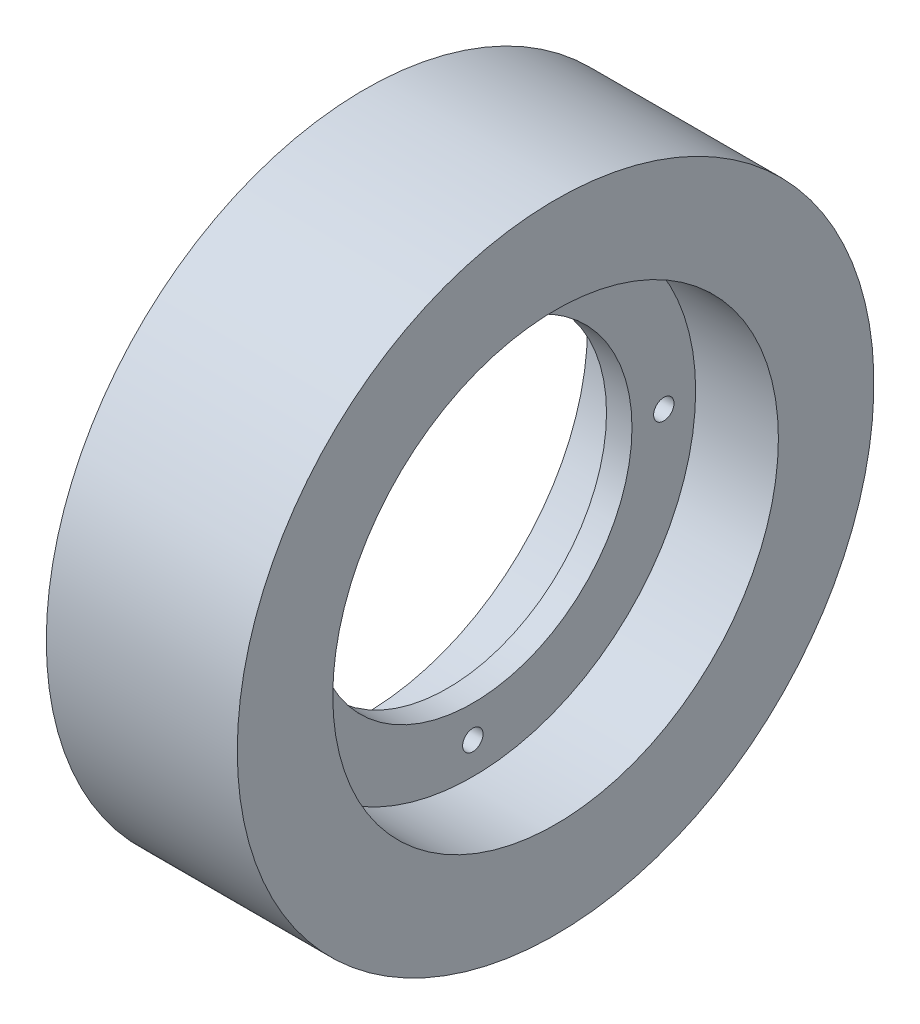
ISO-10303-21;
HEADER;
FILE_DESCRIPTION(('STEP AP214'),'2;1');
FILE_NAME('part.step','',(''),(''),'','','');
FILE_SCHEMA(('AUTOMOTIVE_DESIGN { 1 0 10303 214 1 1 1 1 }'));
ENDSEC;
DATA;
#1=APPLICATION_CONTEXT('core data for automotive mechanical design processes');
#2=APPLICATION_PROTOCOL_DEFINITION('international standard','automotive_design',2000,#1);
#3=PRODUCT_CONTEXT('',#1,'mechanical');
#4=PRODUCT('Part','Part','',(#3));
#5=PRODUCT_RELATED_PRODUCT_CATEGORY('part','',(#4));
#6=PRODUCT_DEFINITION_FORMATION('','',#4);
#7=PRODUCT_DEFINITION_CONTEXT('part definition',#1,'design');
#8=PRODUCT_DEFINITION('design','',#6,#7);
#9=PRODUCT_DEFINITION_SHAPE('','',#8);
#10=(LENGTH_UNIT() NAMED_UNIT(*) SI_UNIT(.MILLI.,.METRE.));
#11=(NAMED_UNIT(*) PLANE_ANGLE_UNIT() SI_UNIT($,.RADIAN.));
#12=(NAMED_UNIT(*) SI_UNIT($,.STERADIAN.) SOLID_ANGLE_UNIT());
#13=UNCERTAINTY_MEASURE_WITH_UNIT(LENGTH_MEASURE(1.E-05),#10,'distance_accuracy_value','');
#14=(GEOMETRIC_REPRESENTATION_CONTEXT(3) GLOBAL_UNCERTAINTY_ASSIGNED_CONTEXT((#13)) GLOBAL_UNIT_ASSIGNED_CONTEXT((#10,
#11,#12)) REPRESENTATION_CONTEXT('',''));
#15=CARTESIAN_POINT('',(0.,0.,0.));
#16=DIRECTION('',(0.,0.,1.));
#17=DIRECTION('',(1.,0.,0.));
#18=AXIS2_PLACEMENT_3D('',#15,#16,#17);
#19=CARTESIAN_POINT('',(-15.,35.,0.));
#20=DIRECTION('',(1.,0.,0.));
#21=DIRECTION('',(0.,0.,-1.));
#22=AXIS2_PLACEMENT_3D('',#19,#20,#21);
#23=PLANE('',#22);
#24=CARTESIAN_POINT('',(-15.,0.,0.));
#25=DIRECTION('',(-1.,0.,0.));
#26=DIRECTION('',(0.,0.,1.));
#27=AXIS2_PLACEMENT_3D('',#24,#25,#26);
#28=CIRCLE('',#27,35.);
#29=CARTESIAN_POINT('',(-15.,0.,35.));
#30=VERTEX_POINT('',#29);
#31=EDGE_CURVE('E10',#30,#30,#28,.T.);
#32=ORIENTED_EDGE('',*,*,#31,.F.);
#33=EDGE_LOOP('',(#32));
#34=FACE_BOUND('',#33,.T.);
#35=CARTESIAN_POINT('',(-15.,0.,0.));
#36=DIRECTION('',(-1.,0.,0.));
#37=DIRECTION('',(0.,0.,1.));
#38=AXIS2_PLACEMENT_3D('',#35,#36,#37);
#39=CIRCLE('',#38,50.);
#40=CARTESIAN_POINT('',(-15.,0.,50.));
#41=VERTEX_POINT('',#40);
#42=EDGE_CURVE('E84',#41,#41,#39,.T.);
#43=ORIENTED_EDGE('',*,*,#42,.T.);
#44=EDGE_LOOP('',(#43));
#45=FACE_BOUND('',#44,.T.);
#46=ADVANCED_FACE('F47',(#34,#45),#23,.F.);
#47=CARTESIAN_POINT('',(0.,0.,0.));
#48=DIRECTION('',(-1.,0.,0.));
#49=DIRECTION('',(0.,0.,1.));
#50=AXIS2_PLACEMENT_3D('',#47,#48,#49);
#51=CYLINDRICAL_SURFACE('',#50,35.);
#52=CARTESIAN_POINT('',(-2.,0.,0.));
#53=DIRECTION('',(-1.,0.,0.));
#54=DIRECTION('',(0.,0.,1.));
#55=AXIS2_PLACEMENT_3D('',#52,#53,#54);
#56=CIRCLE('',#55,35.);
#57=CARTESIAN_POINT('',(-2.,0.,35.));
#58=VERTEX_POINT('',#57);
#59=EDGE_CURVE('E54',#58,#58,#56,.T.);
#60=ORIENTED_EDGE('',*,*,#59,.F.);
#61=EDGE_LOOP('',(#60));
#62=FACE_BOUND('',#61,.T.);
#63=ORIENTED_EDGE('',*,*,#31,.T.);
#64=EDGE_LOOP('',(#63));
#65=FACE_BOUND('',#64,.T.);
#66=ADVANCED_FACE('F148',(#62,#65),#51,.F.);
#67=CARTESIAN_POINT('',(-2.,25.,0.));
#68=DIRECTION('',(1.,0.,0.));
#69=DIRECTION('',(0.,0.,-1.));
#70=AXIS2_PLACEMENT_3D('',#67,#68,#69);
#71=PLANE('',#70);
#72=CARTESIAN_POINT('',(-2.,-1.04744440165294E-13,-30.));
#73=DIRECTION('',(1.,0.,0.));
#74=DIRECTION('',(0.,0.,-1.));
#75=AXIS2_PLACEMENT_3D('',#72,#73,#74);
#76=CIRCLE('',#75,1.6);
#77=CARTESIAN_POINT('',(-2.,-1.04744440165294E-13,-31.6));
#78=VERTEX_POINT('',#77);
#79=EDGE_CURVE('E96',#78,#78,#76,.T.);
#80=ORIENTED_EDGE('',*,*,#79,.T.);
#81=EDGE_LOOP('',(#80));
#82=FACE_BOUND('',#81,.T.);
#83=CARTESIAN_POINT('',(-2.,-30.,0.));
#84=DIRECTION('',(1.,0.,0.));
#85=DIRECTION('',(0.,0.,-1.));
#86=AXIS2_PLACEMENT_3D('',#83,#84,#85);
#87=CIRCLE('',#86,1.6);
#88=CARTESIAN_POINT('',(-2.,-30.,-1.6));
#89=VERTEX_POINT('',#88);
#90=EDGE_CURVE('E100',#89,#89,#87,.T.);
#91=ORIENTED_EDGE('',*,*,#90,.T.);
#92=EDGE_LOOP('',(#91));
#93=FACE_BOUND('',#92,.T.);
#94=CARTESIAN_POINT('',(-2.,3.14233320495882E-13,30.));
#95=DIRECTION('',(1.,0.,0.));
#96=DIRECTION('',(0.,0.,-1.));
#97=AXIS2_PLACEMENT_3D('',#94,#95,#96);
#98=CIRCLE('',#97,1.6);
#99=CARTESIAN_POINT('',(-2.,3.14233320495882E-13,28.4));
#100=VERTEX_POINT('',#99);
#101=EDGE_CURVE('E104',#100,#100,#98,.T.);
#102=ORIENTED_EDGE('',*,*,#101,.T.);
#103=EDGE_LOOP('',(#102));
#104=FACE_BOUND('',#103,.T.);
#105=CARTESIAN_POINT('',(-2.,30.,0.));
#106=DIRECTION('',(1.,0.,0.));
#107=DIRECTION('',(0.,0.,-1.));
#108=AXIS2_PLACEMENT_3D('',#105,#106,#107);
#109=CIRCLE('',#108,1.6);
#110=CARTESIAN_POINT('',(-2.,30.,-1.6));
#111=VERTEX_POINT('',#110);
#112=EDGE_CURVE('E88',#111,#111,#109,.T.);
#113=ORIENTED_EDGE('',*,*,#112,.T.);
#114=EDGE_LOOP('',(#113));
#115=FACE_BOUND('',#114,.T.);
#116=CARTESIAN_POINT('',(-2.,0.,0.));
#117=DIRECTION('',(-1.,0.,0.));
#118=DIRECTION('',(0.,0.,1.));
#119=AXIS2_PLACEMENT_3D('',#116,#117,#118);
#120=CIRCLE('',#119,25.);
#121=CARTESIAN_POINT('',(-2.,0.,25.));
#122=VERTEX_POINT('',#121);
#123=EDGE_CURVE('E60',#122,#122,#120,.T.);
#124=ORIENTED_EDGE('',*,*,#123,.F.);
#125=EDGE_LOOP('',(#124));
#126=FACE_BOUND('',#125,.T.);
#127=ORIENTED_EDGE('',*,*,#59,.T.);
#128=EDGE_LOOP('',(#127));
#129=FACE_BOUND('',#128,.T.);
#130=ADVANCED_FACE('F143',(#82,#93,#104,#115,#126,#129),#71,.F.);
#131=CARTESIAN_POINT('',(0.,0.,0.));
#132=DIRECTION('',(-1.,0.,0.));
#133=DIRECTION('',(0.,0.,1.));
#134=AXIS2_PLACEMENT_3D('',#131,#132,#133);
#135=CYLINDRICAL_SURFACE('',#134,25.);
#136=CARTESIAN_POINT('',(2.,0.,0.));
#137=DIRECTION('',(-1.,0.,0.));
#138=DIRECTION('',(0.,0.,1.));
#139=AXIS2_PLACEMENT_3D('',#136,#137,#138);
#140=CIRCLE('',#139,25.);
#141=CARTESIAN_POINT('',(2.,0.,25.));
#142=VERTEX_POINT('',#141);
#143=EDGE_CURVE('E66',#142,#142,#140,.T.);
#144=ORIENTED_EDGE('',*,*,#143,.F.);
#145=EDGE_LOOP('',(#144));
#146=FACE_BOUND('',#145,.T.);
#147=ORIENTED_EDGE('',*,*,#123,.T.);
#148=EDGE_LOOP('',(#147));
#149=FACE_BOUND('',#148,.T.);
#150=ADVANCED_FACE('F129',(#146,#149),#135,.F.);
#151=CARTESIAN_POINT('',(2.,35.,0.));
#152=DIRECTION('',(-1.,0.,0.));
#153=DIRECTION('',(0.,0.,1.));
#154=AXIS2_PLACEMENT_3D('',#151,#152,#153);
#155=PLANE('',#154);
#156=CARTESIAN_POINT('',(2.,-1.04744440165294E-13,-30.));
#157=DIRECTION('',(1.,0.,0.));
#158=DIRECTION('',(0.,-1.,0.));
#159=AXIS2_PLACEMENT_3D('',#156,#157,#158);
#160=CIRCLE('',#159,1.6);
#161=CARTESIAN_POINT('',(2.,-1.60000000000011,-30.));
#162=VERTEX_POINT('',#161);
#163=EDGE_CURVE('E108',#162,#162,#160,.T.);
#164=ORIENTED_EDGE('',*,*,#163,.F.);
#165=EDGE_LOOP('',(#164));
#166=FACE_BOUND('',#165,.T.);
#167=CARTESIAN_POINT('',(2.,-30.,0.));
#168=DIRECTION('',(1.,0.,0.));
#169=DIRECTION('',(0.,0.,1.));
#170=AXIS2_PLACEMENT_3D('',#167,#168,#169);
#171=CIRCLE('',#170,1.6);
#172=CARTESIAN_POINT('',(2.,-30.,1.6));
#173=VERTEX_POINT('',#172);
#174=EDGE_CURVE('E113',#173,#173,#171,.T.);
#175=ORIENTED_EDGE('',*,*,#174,.F.);
#176=EDGE_LOOP('',(#175));
#177=FACE_BOUND('',#176,.T.);
#178=CARTESIAN_POINT('',(2.,3.14233320495882E-13,30.));
#179=DIRECTION('',(1.,0.,0.));
#180=DIRECTION('',(0.,1.,0.));
#181=AXIS2_PLACEMENT_3D('',#178,#179,#180);
#182=CIRCLE('',#181,1.6);
#183=CARTESIAN_POINT('',(2.,1.60000000000031,30.));
#184=VERTEX_POINT('',#183);
#185=EDGE_CURVE('E109',#184,#184,#182,.T.);
#186=ORIENTED_EDGE('',*,*,#185,.F.);
#187=EDGE_LOOP('',(#186));
#188=FACE_BOUND('',#187,.T.);
#189=CARTESIAN_POINT('',(2.,30.,0.));
#190=DIRECTION('',(1.,0.,0.));
#191=DIRECTION('',(0.,0.,-1.));
#192=AXIS2_PLACEMENT_3D('',#189,#190,#191);
#193=CIRCLE('',#192,1.6);
#194=CARTESIAN_POINT('',(2.,30.,-1.6));
#195=VERTEX_POINT('',#194);
#196=EDGE_CURVE('E92',#195,#195,#193,.T.);
#197=ORIENTED_EDGE('',*,*,#196,.F.);
#198=EDGE_LOOP('',(#197));
#199=FACE_BOUND('',#198,.T.);
#200=CARTESIAN_POINT('',(2.,0.,0.));
#201=DIRECTION('',(-1.,0.,0.));
#202=DIRECTION('',(0.,0.,1.));
#203=AXIS2_PLACEMENT_3D('',#200,#201,#202);
#204=CIRCLE('',#203,35.);
#205=CARTESIAN_POINT('',(2.,0.,35.));
#206=VERTEX_POINT('',#205);
#207=EDGE_CURVE('E72',#206,#206,#204,.T.);
#208=ORIENTED_EDGE('',*,*,#207,.F.);
#209=EDGE_LOOP('',(#208));
#210=FACE_BOUND('',#209,.T.);
#211=ORIENTED_EDGE('',*,*,#143,.T.);
#212=EDGE_LOOP('',(#211));
#213=FACE_BOUND('',#212,.T.);
#214=ADVANCED_FACE('F125',(#166,#177,#188,#199,#210,#213),#155,.F.);
#215=CARTESIAN_POINT('',(0.,0.,0.));
#216=DIRECTION('',(-1.,0.,0.));
#217=DIRECTION('',(0.,0.,1.));
#218=AXIS2_PLACEMENT_3D('',#215,#216,#217);
#219=CYLINDRICAL_SURFACE('',#218,35.);
#220=CARTESIAN_POINT('',(15.,0.,0.));
#221=DIRECTION('',(-1.,0.,0.));
#222=DIRECTION('',(0.,0.,1.));
#223=AXIS2_PLACEMENT_3D('',#220,#221,#222);
#224=CIRCLE('',#223,35.);
#225=CARTESIAN_POINT('',(15.,0.,35.));
#226=VERTEX_POINT('',#225);
#227=EDGE_CURVE('E76',#226,#226,#224,.T.);
#228=ORIENTED_EDGE('',*,*,#227,.F.);
#229=EDGE_LOOP('',(#228));
#230=FACE_BOUND('',#229,.T.);
#231=ORIENTED_EDGE('',*,*,#207,.T.);
#232=EDGE_LOOP('',(#231));
#233=FACE_BOUND('',#232,.T.);
#234=ADVANCED_FACE('F128',(#230,#233),#219,.F.);
#235=CARTESIAN_POINT('',(15.,50.,0.));
#236=DIRECTION('',(-1.,0.,0.));
#237=DIRECTION('',(0.,0.,1.));
#238=AXIS2_PLACEMENT_3D('',#235,#236,#237);
#239=PLANE('',#238);
#240=CARTESIAN_POINT('',(15.,0.,0.));
#241=DIRECTION('',(-1.,0.,0.));
#242=DIRECTION('',(0.,0.,1.));
#243=AXIS2_PLACEMENT_3D('',#240,#241,#242);
#244=CIRCLE('',#243,50.);
#245=CARTESIAN_POINT('',(15.,0.,50.));
#246=VERTEX_POINT('',#245);
#247=EDGE_CURVE('E80',#246,#246,#244,.T.);
#248=ORIENTED_EDGE('',*,*,#247,.F.);
#249=EDGE_LOOP('',(#248));
#250=FACE_BOUND('',#249,.T.);
#251=ORIENTED_EDGE('',*,*,#227,.T.);
#252=EDGE_LOOP('',(#251));
#253=FACE_BOUND('',#252,.T.);
#254=ADVANCED_FACE('F168',(#250,#253),#239,.F.);
#255=CARTESIAN_POINT('',(0.,0.,0.));
#256=DIRECTION('',(-1.,0.,0.));
#257=DIRECTION('',(0.,0.,1.));
#258=AXIS2_PLACEMENT_3D('',#255,#256,#257);
#259=CYLINDRICAL_SURFACE('',#258,50.);
#260=ORIENTED_EDGE('',*,*,#42,.F.);
#261=EDGE_LOOP('',(#260));
#262=FACE_BOUND('',#261,.T.);
#263=ORIENTED_EDGE('',*,*,#247,.T.);
#264=EDGE_LOOP('',(#263));
#265=FACE_BOUND('',#264,.T.);
#266=ADVANCED_FACE('F164',(#262,#265),#259,.T.);
#267=CARTESIAN_POINT('',(-15.,30.,0.));
#268=DIRECTION('',(1.,0.,0.));
#269=DIRECTION('',(0.,0.,-1.));
#270=AXIS2_PLACEMENT_3D('',#267,#268,#269);
#271=CYLINDRICAL_SURFACE('',#270,1.6);
#272=ORIENTED_EDGE('',*,*,#196,.T.);
#273=EDGE_LOOP('',(#272));
#274=FACE_BOUND('',#273,.T.);
#275=ORIENTED_EDGE('',*,*,#112,.F.);
#276=EDGE_LOOP('',(#275));
#277=FACE_BOUND('',#276,.T.);
#278=ADVANCED_FACE('F167',(#274,#277),#271,.F.);
#279=CARTESIAN_POINT('',(-15.,3.14233320495882E-13,30.));
#280=DIRECTION('',(1.,0.,0.));
#281=DIRECTION('',(0.,0.,-1.));
#282=AXIS2_PLACEMENT_3D('',#279,#280,#281);
#283=CYLINDRICAL_SURFACE('',#282,1.6);
#284=ORIENTED_EDGE('',*,*,#185,.T.);
#285=EDGE_LOOP('',(#284));
#286=FACE_BOUND('',#285,.T.);
#287=ORIENTED_EDGE('',*,*,#101,.F.);
#288=EDGE_LOOP('',(#287));
#289=FACE_BOUND('',#288,.T.);
#290=ADVANCED_FACE('F184',(#286,#289),#283,.F.);
#291=CARTESIAN_POINT('',(-15.,-30.,0.));
#292=DIRECTION('',(1.,0.,0.));
#293=DIRECTION('',(0.,0.,-1.));
#294=AXIS2_PLACEMENT_3D('',#291,#292,#293);
#295=CYLINDRICAL_SURFACE('',#294,1.6);
#296=ORIENTED_EDGE('',*,*,#174,.T.);
#297=EDGE_LOOP('',(#296));
#298=FACE_BOUND('',#297,.T.);
#299=ORIENTED_EDGE('',*,*,#90,.F.);
#300=EDGE_LOOP('',(#299));
#301=FACE_BOUND('',#300,.T.);
#302=ADVANCED_FACE('F188',(#298,#301),#295,.F.);
#303=CARTESIAN_POINT('',(-15.,-1.04744440165294E-13,-30.));
#304=DIRECTION('',(1.,0.,0.));
#305=DIRECTION('',(0.,0.,-1.));
#306=AXIS2_PLACEMENT_3D('',#303,#304,#305);
#307=CYLINDRICAL_SURFACE('',#306,1.6);
#308=ORIENTED_EDGE('',*,*,#163,.T.);
#309=EDGE_LOOP('',(#308));
#310=FACE_BOUND('',#309,.T.);
#311=ORIENTED_EDGE('',*,*,#79,.F.);
#312=EDGE_LOOP('',(#311));
#313=FACE_BOUND('',#312,.T.);
#314=ADVANCED_FACE('F122',(#310,#313),#307,.F.);
#315=CLOSED_SHELL('',(#46,#66,#130,#150,#214,#234,#254,#266,#278,#290,#302,#314));
#316=MANIFOLD_SOLID_BREP('B2',#315);
#317=ADVANCED_BREP_SHAPE_REPRESENTATION('',(#18,#316),#14);
#318=SHAPE_DEFINITION_REPRESENTATION(#9,#317);
ENDSEC;
END-ISO-10303-21;
